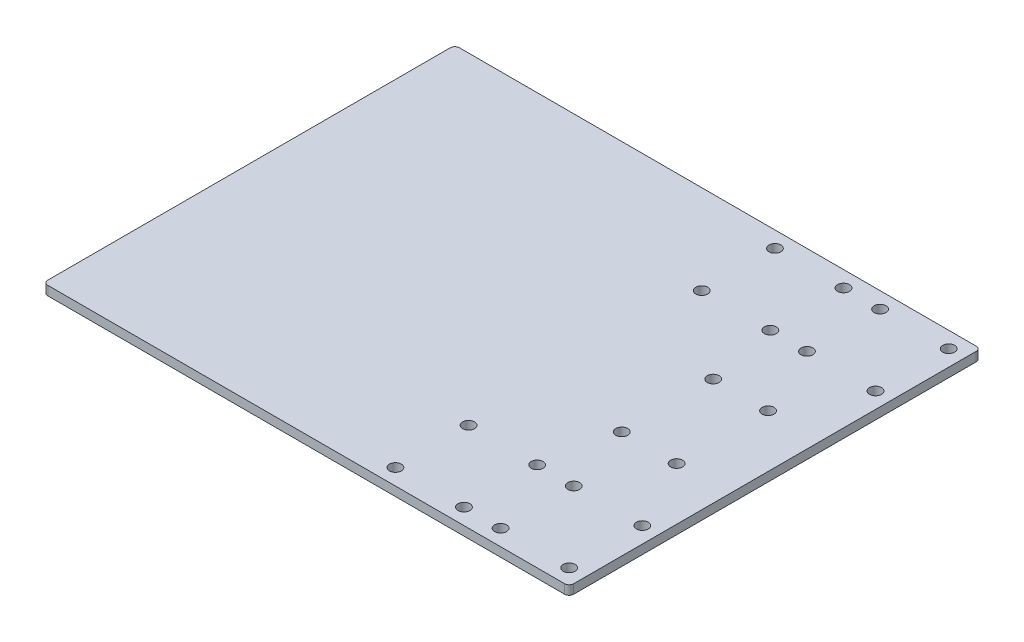
ISO-10303-21;
HEADER;
FILE_DESCRIPTION(('STEP AP214'),'2;1');
FILE_NAME('part.step','',(''),(''),'','','');
FILE_SCHEMA(('AUTOMOTIVE_DESIGN { 1 0 10303 214 1 1 1 1 }'));
ENDSEC;
DATA;
#1=APPLICATION_CONTEXT('core data for automotive mechanical design processes');
#2=APPLICATION_PROTOCOL_DEFINITION('international standard','automotive_design',2000,#1);
#3=PRODUCT_CONTEXT('',#1,'mechanical');
#4=PRODUCT('Part','Part','',(#3));
#5=PRODUCT_RELATED_PRODUCT_CATEGORY('part','',(#4));
#6=PRODUCT_DEFINITION_FORMATION('','',#4);
#7=PRODUCT_DEFINITION_CONTEXT('part definition',#1,'design');
#8=PRODUCT_DEFINITION('design','',#6,#7);
#9=PRODUCT_DEFINITION_SHAPE('','',#8);
#10=(LENGTH_UNIT() NAMED_UNIT(*) SI_UNIT(.MILLI.,.METRE.));
#11=(NAMED_UNIT(*) PLANE_ANGLE_UNIT() SI_UNIT($,.RADIAN.));
#12=(NAMED_UNIT(*) SI_UNIT($,.STERADIAN.) SOLID_ANGLE_UNIT());
#13=UNCERTAINTY_MEASURE_WITH_UNIT(LENGTH_MEASURE(1.E-05),#10,'distance_accuracy_value','');
#14=(GEOMETRIC_REPRESENTATION_CONTEXT(3) GLOBAL_UNCERTAINTY_ASSIGNED_CONTEXT((#13)) GLOBAL_UNIT_ASSIGNED_CONTEXT((#10,
#11,#12)) REPRESENTATION_CONTEXT('',''));
#15=CARTESIAN_POINT('',(0.,0.,0.));
#16=DIRECTION('',(0.,0.,1.));
#17=DIRECTION('',(1.,0.,0.));
#18=AXIS2_PLACEMENT_3D('',#15,#16,#17);
#19=CARTESIAN_POINT('',(0.,4.,0.));
#20=DIRECTION('',(1.,0.,0.));
#21=DIRECTION('',(0.,0.,-1.));
#22=AXIS2_PLACEMENT_3D('',#19,#20,#21);
#23=PLANE('',#22);
#24=DIRECTION('',(0.,0.,1.));
#25=VECTOR('',#24,1.);
#26=CARTESIAN_POINT('',(0.,4.,0.));
#27=LINE('',#26,#25);
#28=CARTESIAN_POINT('',(0.,4.,-178.));
#29=VERTEX_POINT('',#28);
#30=CARTESIAN_POINT('',(0.,4.,-2.));
#31=VERTEX_POINT('',#30);
#32=EDGE_CURVE('E130',#29,#31,#27,.T.);
#33=ORIENTED_EDGE('',*,*,#32,.F.);
#34=DIRECTION('',(0.,-1.,0.));
#35=VECTOR('',#34,1.);
#36=CARTESIAN_POINT('',(0.,4.,-178.));
#37=LINE('',#36,#35);
#38=CARTESIAN_POINT('',(0.,0.,-178.));
#39=VERTEX_POINT('',#38);
#40=EDGE_CURVE('E11',#29,#39,#37,.T.);
#41=ORIENTED_EDGE('',*,*,#40,.T.);
#42=DIRECTION('',(0.,0.,1.));
#43=VECTOR('',#42,1.);
#44=CARTESIAN_POINT('',(0.,0.,0.));
#45=LINE('',#44,#43);
#46=CARTESIAN_POINT('',(0.,0.,-2.));
#47=VERTEX_POINT('',#46);
#48=EDGE_CURVE('E132',#39,#47,#45,.T.);
#49=ORIENTED_EDGE('',*,*,#48,.T.);
#50=DIRECTION('',(0.,-1.,0.));
#51=VECTOR('',#50,1.);
#52=CARTESIAN_POINT('',(0.,4.,-2.));
#53=LINE('',#52,#51);
#54=EDGE_CURVE('E43',#47,#31,#53,.F.);
#55=ORIENTED_EDGE('',*,*,#54,.T.);
#56=EDGE_LOOP('',(#33,#41,#49,#55));
#57=FACE_BOUND('',#56,.T.);
#58=ADVANCED_FACE('F35',(#57),#23,.F.);
#59=CARTESIAN_POINT('',(0.,4.,0.));
#60=DIRECTION('',(0.,0.,-1.));
#61=DIRECTION('',(-1.,0.,0.));
#62=AXIS2_PLACEMENT_3D('',#59,#60,#61);
#63=PLANE('',#62);
#64=DIRECTION('',(1.,0.,0.));
#65=VECTOR('',#64,1.);
#66=CARTESIAN_POINT('',(0.,0.,0.));
#67=LINE('',#66,#65);
#68=CARTESIAN_POINT('',(2.,0.,0.));
#69=VERTEX_POINT('',#68);
#70=CARTESIAN_POINT('',(228.,0.,0.));
#71=VERTEX_POINT('',#70);
#72=EDGE_CURVE('E128',#69,#71,#67,.T.);
#73=ORIENTED_EDGE('',*,*,#72,.T.);
#74=DIRECTION('',(0.,-1.,0.));
#75=VECTOR('',#74,1.);
#76=CARTESIAN_POINT('',(228.,4.,0.));
#77=LINE('',#76,#75);
#78=CARTESIAN_POINT('',(228.,4.,0.));
#79=VERTEX_POINT('',#78);
#80=EDGE_CURVE('E107',#71,#79,#77,.F.);
#81=ORIENTED_EDGE('',*,*,#80,.T.);
#82=DIRECTION('',(1.,0.,0.));
#83=VECTOR('',#82,1.);
#84=CARTESIAN_POINT('',(0.,4.,0.));
#85=LINE('',#84,#83);
#86=CARTESIAN_POINT('',(2.,4.,0.));
#87=VERTEX_POINT('',#86);
#88=EDGE_CURVE('E168',#87,#79,#85,.T.);
#89=ORIENTED_EDGE('',*,*,#88,.F.);
#90=DIRECTION('',(0.,-1.,0.));
#91=VECTOR('',#90,1.);
#92=CARTESIAN_POINT('',(2.,4.,0.));
#93=LINE('',#92,#91);
#94=EDGE_CURVE('E112',#87,#69,#93,.T.);
#95=ORIENTED_EDGE('',*,*,#94,.T.);
#96=EDGE_LOOP('',(#73,#81,#89,#95));
#97=FACE_BOUND('',#96,.T.);
#98=ADVANCED_FACE('F172',(#97),#63,.F.);
#99=CARTESIAN_POINT('',(230.,4.,-180.));
#100=DIRECTION('',(-1.,0.,0.));
#101=DIRECTION('',(0.,0.,1.));
#102=AXIS2_PLACEMENT_3D('',#99,#100,#101);
#103=PLANE('',#102);
#104=DIRECTION('',(0.,0.,-1.));
#105=VECTOR('',#104,1.);
#106=CARTESIAN_POINT('',(230.,4.,-180.));
#107=LINE('',#106,#105);
#108=CARTESIAN_POINT('',(230.,4.,-2.00000000000006));
#109=VERTEX_POINT('',#108);
#110=CARTESIAN_POINT('',(230.,4.,-178.));
#111=VERTEX_POINT('',#110);
#112=EDGE_CURVE('E121',#109,#111,#107,.T.);
#113=ORIENTED_EDGE('',*,*,#112,.F.);
#114=DIRECTION('',(0.,-1.,0.));
#115=VECTOR('',#114,1.);
#116=CARTESIAN_POINT('',(230.,4.,-2.));
#117=LINE('',#116,#115);
#118=CARTESIAN_POINT('',(230.,0.,-2.00000000000006));
#119=VERTEX_POINT('',#118);
#120=EDGE_CURVE('E106',#109,#119,#117,.T.);
#121=ORIENTED_EDGE('',*,*,#120,.T.);
#122=DIRECTION('',(0.,0.,-1.));
#123=VECTOR('',#122,1.);
#124=CARTESIAN_POINT('',(230.,0.,-180.));
#125=LINE('',#124,#123);
#126=CARTESIAN_POINT('',(230.,0.,-178.));
#127=VERTEX_POINT('',#126);
#128=EDGE_CURVE('E119',#119,#127,#125,.T.);
#129=ORIENTED_EDGE('',*,*,#128,.T.);
#130=DIRECTION('',(0.,-1.,0.));
#131=VECTOR('',#130,1.);
#132=CARTESIAN_POINT('',(230.,4.,-178.));
#133=LINE('',#132,#131);
#134=EDGE_CURVE('E123',#127,#111,#133,.F.);
#135=ORIENTED_EDGE('',*,*,#134,.T.);
#136=EDGE_LOOP('',(#113,#121,#129,#135));
#137=FACE_BOUND('',#136,.T.);
#138=ADVANCED_FACE('F118',(#137),#103,.F.);
#139=CARTESIAN_POINT('',(0.,4.,-180.));
#140=DIRECTION('',(0.,0.,1.));
#141=DIRECTION('',(1.,0.,0.));
#142=AXIS2_PLACEMENT_3D('',#139,#140,#141);
#143=PLANE('',#142);
#144=DIRECTION('',(-1.,0.,0.));
#145=VECTOR('',#144,1.);
#146=CARTESIAN_POINT('',(0.,4.,-180.));
#147=LINE('',#146,#145);
#148=CARTESIAN_POINT('',(228.,4.,-180.));
#149=VERTEX_POINT('',#148);
#150=CARTESIAN_POINT('',(2.,4.,-180.));
#151=VERTEX_POINT('',#150);
#152=EDGE_CURVE('E136',#149,#151,#147,.T.);
#153=ORIENTED_EDGE('',*,*,#152,.F.);
#154=DIRECTION('',(0.,-1.,0.));
#155=VECTOR('',#154,1.);
#156=CARTESIAN_POINT('',(228.,4.,-180.));
#157=LINE('',#156,#155);
#158=CARTESIAN_POINT('',(228.,0.,-180.));
#159=VERTEX_POINT('',#158);
#160=EDGE_CURVE('E153',#149,#159,#157,.T.);
#161=ORIENTED_EDGE('',*,*,#160,.T.);
#162=DIRECTION('',(-1.,0.,0.));
#163=VECTOR('',#162,1.);
#164=CARTESIAN_POINT('',(0.,0.,-180.));
#165=LINE('',#164,#163);
#166=CARTESIAN_POINT('',(2.,0.,-180.));
#167=VERTEX_POINT('',#166);
#168=EDGE_CURVE('E127',#159,#167,#165,.T.);
#169=ORIENTED_EDGE('',*,*,#168,.T.);
#170=DIRECTION('',(0.,-1.,0.));
#171=VECTOR('',#170,1.);
#172=CARTESIAN_POINT('',(2.,4.,-180.));
#173=LINE('',#172,#171);
#174=EDGE_CURVE('E50',#167,#151,#173,.F.);
#175=ORIENTED_EDGE('',*,*,#174,.T.);
#176=EDGE_LOOP('',(#153,#161,#169,#175));
#177=FACE_BOUND('',#176,.T.);
#178=ADVANCED_FACE('F302',(#177),#143,.F.);
#179=CARTESIAN_POINT('',(0.,4.,0.));
#180=DIRECTION('',(0.,-1.,0.));
#181=DIRECTION('',(0.,0.,-1.));
#182=AXIS2_PLACEMENT_3D('',#179,#180,#181);
#183=PLANE('',#182);
#184=CARTESIAN_POINT('',(183.,4.,-70.));
#185=DIRECTION('',(0.,1.,0.));
#186=DIRECTION('',(0.,0.,1.));
#187=AXIS2_PLACEMENT_3D('',#184,#185,#186);
#188=CIRCLE('',#187,2.59999999999999);
#189=CARTESIAN_POINT('',(183.,4.,-67.4));
#190=VERTEX_POINT('',#189);
#191=EDGE_CURVE('E294',#190,#190,#188,.T.);
#192=ORIENTED_EDGE('',*,*,#191,.F.);
#193=EDGE_LOOP('',(#192));
#194=FACE_BOUND('',#193,.T.);
#195=CARTESIAN_POINT('',(183.,4.,-110.));
#196=DIRECTION('',(0.,1.,0.));
#197=DIRECTION('',(0.,0.,1.));
#198=AXIS2_PLACEMENT_3D('',#195,#196,#197);
#199=CIRCLE('',#198,2.59999999999999);
#200=CARTESIAN_POINT('',(183.,4.,-107.4));
#201=VERTEX_POINT('',#200);
#202=EDGE_CURVE('E288',#201,#201,#199,.T.);
#203=ORIENTED_EDGE('',*,*,#202,.F.);
#204=EDGE_LOOP('',(#203));
#205=FACE_BOUND('',#204,.T.);
#206=CARTESIAN_POINT('',(207.,4.,-70.));
#207=DIRECTION('',(0.,1.,0.));
#208=DIRECTION('',(0.,0.,1.));
#209=AXIS2_PLACEMENT_3D('',#206,#207,#208);
#210=CIRCLE('',#209,2.59999999999999);
#211=CARTESIAN_POINT('',(207.,4.,-67.4));
#212=VERTEX_POINT('',#211);
#213=EDGE_CURVE('E282',#212,#212,#210,.T.);
#214=ORIENTED_EDGE('',*,*,#213,.F.);
#215=EDGE_LOOP('',(#214));
#216=FACE_BOUND('',#215,.T.);
#217=CARTESIAN_POINT('',(207.,4.,-110.));
#218=DIRECTION('',(0.,1.,0.));
#219=DIRECTION('',(0.,0.,1.));
#220=AXIS2_PLACEMENT_3D('',#217,#218,#219);
#221=CIRCLE('',#220,2.59999999999999);
#222=CARTESIAN_POINT('',(207.,4.,-107.4));
#223=VERTEX_POINT('',#222);
#224=EDGE_CURVE('E276',#223,#223,#221,.T.);
#225=ORIENTED_EDGE('',*,*,#224,.F.);
#226=EDGE_LOOP('',(#225));
#227=FACE_BOUND('',#226,.T.);
#228=CARTESIAN_POINT('',(223.,4.,-39.));
#229=DIRECTION('',(0.,1.,0.));
#230=DIRECTION('',(0.,0.,1.));
#231=AXIS2_PLACEMENT_3D('',#228,#229,#230);
#232=CIRCLE('',#231,2.59999999999999);
#233=CARTESIAN_POINT('',(223.,4.,-36.4));
#234=VERTEX_POINT('',#233);
#235=EDGE_CURVE('E270',#234,#234,#232,.T.);
#236=ORIENTED_EDGE('',*,*,#235,.F.);
#237=EDGE_LOOP('',(#236));
#238=FACE_BOUND('',#237,.T.);
#239=CARTESIAN_POINT('',(223.,4.,-7.));
#240=DIRECTION('',(0.,1.,0.));
#241=DIRECTION('',(0.,0.,1.));
#242=AXIS2_PLACEMENT_3D('',#239,#240,#241);
#243=CIRCLE('',#242,2.59999999999999);
#244=CARTESIAN_POINT('',(223.,4.,-4.40000000000001));
#245=VERTEX_POINT('',#244);
#246=EDGE_CURVE('E264',#245,#245,#243,.T.);
#247=ORIENTED_EDGE('',*,*,#246,.F.);
#248=EDGE_LOOP('',(#247));
#249=FACE_BOUND('',#248,.T.);
#250=CARTESIAN_POINT('',(193.,4.,-7.));
#251=DIRECTION('',(0.,1.,0.));
#252=DIRECTION('',(0.,0.,1.));
#253=AXIS2_PLACEMENT_3D('',#250,#251,#252);
#254=CIRCLE('',#253,2.59999999999999);
#255=CARTESIAN_POINT('',(193.,4.,-4.40000000000001));
#256=VERTEX_POINT('',#255);
#257=EDGE_CURVE('E258',#256,#256,#254,.T.);
#258=ORIENTED_EDGE('',*,*,#257,.F.);
#259=EDGE_LOOP('',(#258));
#260=FACE_BOUND('',#259,.T.);
#261=CARTESIAN_POINT('',(193.,4.,-39.));
#262=DIRECTION('',(0.,1.,0.));
#263=DIRECTION('',(0.,0.,1.));
#264=AXIS2_PLACEMENT_3D('',#261,#262,#263);
#265=CIRCLE('',#264,2.59999999999999);
#266=CARTESIAN_POINT('',(193.,4.,-36.4));
#267=VERTEX_POINT('',#266);
#268=EDGE_CURVE('E252',#267,#267,#265,.T.);
#269=ORIENTED_EDGE('',*,*,#268,.F.);
#270=EDGE_LOOP('',(#269));
#271=FACE_BOUND('',#270,.T.);
#272=CARTESIAN_POINT('',(147.,4.,-39.));
#273=DIRECTION('',(0.,1.,0.));
#274=DIRECTION('',(0.,0.,1.));
#275=AXIS2_PLACEMENT_3D('',#272,#273,#274);
#276=CIRCLE('',#275,2.59999999999999);
#277=CARTESIAN_POINT('',(147.,4.,-36.4));
#278=VERTEX_POINT('',#277);
#279=EDGE_CURVE('E246',#278,#278,#276,.T.);
#280=ORIENTED_EDGE('',*,*,#279,.F.);
#281=EDGE_LOOP('',(#280));
#282=FACE_BOUND('',#281,.T.);
#283=CARTESIAN_POINT('',(177.,4.,-39.));
#284=DIRECTION('',(0.,1.,0.));
#285=DIRECTION('',(0.,0.,1.));
#286=AXIS2_PLACEMENT_3D('',#283,#284,#285);
#287=CIRCLE('',#286,2.59999999999999);
#288=CARTESIAN_POINT('',(177.,4.,-36.4));
#289=VERTEX_POINT('',#288);
#290=EDGE_CURVE('E240',#289,#289,#287,.T.);
#291=ORIENTED_EDGE('',*,*,#290,.F.);
#292=EDGE_LOOP('',(#291));
#293=FACE_BOUND('',#292,.T.);
#294=CARTESIAN_POINT('',(147.,4.,-7.));
#295=DIRECTION('',(0.,1.,0.));
#296=DIRECTION('',(0.,0.,1.));
#297=AXIS2_PLACEMENT_3D('',#294,#295,#296);
#298=CIRCLE('',#297,2.59999999999999);
#299=CARTESIAN_POINT('',(147.,4.,-4.40000000000001));
#300=VERTEX_POINT('',#299);
#301=EDGE_CURVE('E234',#300,#300,#298,.T.);
#302=ORIENTED_EDGE('',*,*,#301,.F.);
#303=EDGE_LOOP('',(#302));
#304=FACE_BOUND('',#303,.T.);
#305=CARTESIAN_POINT('',(177.,4.,-7.));
#306=DIRECTION('',(0.,1.,0.));
#307=DIRECTION('',(0.,0.,1.));
#308=AXIS2_PLACEMENT_3D('',#305,#306,#307);
#309=CIRCLE('',#308,2.59999999999999);
#310=CARTESIAN_POINT('',(177.,4.,-4.40000000000001));
#311=VERTEX_POINT('',#310);
#312=EDGE_CURVE('E228',#311,#311,#309,.T.);
#313=ORIENTED_EDGE('',*,*,#312,.F.);
#314=EDGE_LOOP('',(#313));
#315=FACE_BOUND('',#314,.T.);
#316=CARTESIAN_POINT('',(193.,4.,-173.));
#317=DIRECTION('',(0.,1.,0.));
#318=DIRECTION('',(0.,0.,1.));
#319=AXIS2_PLACEMENT_3D('',#316,#317,#318);
#320=CIRCLE('',#319,2.59999999999999);
#321=CARTESIAN_POINT('',(193.,4.,-170.4));
#322=VERTEX_POINT('',#321);
#323=EDGE_CURVE('E222',#322,#322,#320,.T.);
#324=ORIENTED_EDGE('',*,*,#323,.F.);
#325=EDGE_LOOP('',(#324));
#326=FACE_BOUND('',#325,.T.);
#327=CARTESIAN_POINT('',(223.,4.,-173.));
#328=DIRECTION('',(0.,1.,0.));
#329=DIRECTION('',(0.,0.,1.));
#330=AXIS2_PLACEMENT_3D('',#327,#328,#329);
#331=CIRCLE('',#330,2.59999999999999);
#332=CARTESIAN_POINT('',(223.,4.,-170.4));
#333=VERTEX_POINT('',#332);
#334=EDGE_CURVE('E216',#333,#333,#331,.T.);
#335=ORIENTED_EDGE('',*,*,#334,.F.);
#336=EDGE_LOOP('',(#335));
#337=FACE_BOUND('',#336,.T.);
#338=CARTESIAN_POINT('',(223.,4.,-141.));
#339=DIRECTION('',(0.,1.,0.));
#340=DIRECTION('',(0.,0.,1.));
#341=AXIS2_PLACEMENT_3D('',#338,#339,#340);
#342=CIRCLE('',#341,2.59999999999999);
#343=CARTESIAN_POINT('',(223.,4.,-138.4));
#344=VERTEX_POINT('',#343);
#345=EDGE_CURVE('E210',#344,#344,#342,.T.);
#346=ORIENTED_EDGE('',*,*,#345,.F.);
#347=EDGE_LOOP('',(#346));
#348=FACE_BOUND('',#347,.T.);
#349=CARTESIAN_POINT('',(193.,4.,-141.));
#350=DIRECTION('',(0.,1.,0.));
#351=DIRECTION('',(0.,0.,1.));
#352=AXIS2_PLACEMENT_3D('',#349,#350,#351);
#353=CIRCLE('',#352,2.59999999999999);
#354=CARTESIAN_POINT('',(193.,4.,-138.4));
#355=VERTEX_POINT('',#354);
#356=EDGE_CURVE('E204',#355,#355,#353,.T.);
#357=ORIENTED_EDGE('',*,*,#356,.F.);
#358=EDGE_LOOP('',(#357));
#359=FACE_BOUND('',#358,.T.);
#360=CARTESIAN_POINT('',(177.,4.,-173.));
#361=DIRECTION('',(0.,1.,0.));
#362=DIRECTION('',(0.,0.,1.));
#363=AXIS2_PLACEMENT_3D('',#360,#361,#362);
#364=CIRCLE('',#363,2.59999999999999);
#365=CARTESIAN_POINT('',(177.,4.,-170.4));
#366=VERTEX_POINT('',#365);
#367=EDGE_CURVE('E198',#366,#366,#364,.T.);
#368=ORIENTED_EDGE('',*,*,#367,.F.);
#369=EDGE_LOOP('',(#368));
#370=FACE_BOUND('',#369,.T.);
#371=CARTESIAN_POINT('',(147.,4.,-173.));
#372=DIRECTION('',(0.,1.,0.));
#373=DIRECTION('',(0.,0.,1.));
#374=AXIS2_PLACEMENT_3D('',#371,#372,#373);
#375=CIRCLE('',#374,2.59999999999999);
#376=CARTESIAN_POINT('',(147.,4.,-170.4));
#377=VERTEX_POINT('',#376);
#378=EDGE_CURVE('E192',#377,#377,#375,.T.);
#379=ORIENTED_EDGE('',*,*,#378,.F.);
#380=EDGE_LOOP('',(#379));
#381=FACE_BOUND('',#380,.T.);
#382=CARTESIAN_POINT('',(177.,4.,-141.));
#383=DIRECTION('',(0.,1.,0.));
#384=DIRECTION('',(0.,0.,1.));
#385=AXIS2_PLACEMENT_3D('',#382,#383,#384);
#386=CIRCLE('',#385,2.59999999999999);
#387=CARTESIAN_POINT('',(177.,4.,-138.4));
#388=VERTEX_POINT('',#387);
#389=EDGE_CURVE('E186',#388,#388,#386,.T.);
#390=ORIENTED_EDGE('',*,*,#389,.F.);
#391=EDGE_LOOP('',(#390));
#392=FACE_BOUND('',#391,.T.);
#393=CARTESIAN_POINT('',(147.,4.,-141.));
#394=DIRECTION('',(0.,1.,0.));
#395=DIRECTION('',(0.,0.,1.));
#396=AXIS2_PLACEMENT_3D('',#393,#394,#395);
#397=CIRCLE('',#396,2.59999999999999);
#398=CARTESIAN_POINT('',(147.,4.,-138.4));
#399=VERTEX_POINT('',#398);
#400=EDGE_CURVE('E175',#399,#399,#397,.T.);
#401=ORIENTED_EDGE('',*,*,#400,.F.);
#402=EDGE_LOOP('',(#401));
#403=FACE_BOUND('',#402,.T.);
#404=ORIENTED_EDGE('',*,*,#88,.T.);
#405=CARTESIAN_POINT('',(228.,4.,-2.));
#406=DIRECTION('',(0.,-1.,0.));
#407=DIRECTION('',(0.,0.,-1.));
#408=AXIS2_PLACEMENT_3D('',#405,#406,#407);
#409=CIRCLE('',#408,2.);
#410=EDGE_CURVE('E150',#79,#109,#409,.F.);
#411=ORIENTED_EDGE('',*,*,#410,.T.);
#412=ORIENTED_EDGE('',*,*,#112,.T.);
#413=CARTESIAN_POINT('',(228.,4.,-178.));
#414=DIRECTION('',(0.,-1.,0.));
#415=DIRECTION('',(0.,0.,-1.));
#416=AXIS2_PLACEMENT_3D('',#413,#414,#415);
#417=CIRCLE('',#416,2.);
#418=EDGE_CURVE('E57',#111,#149,#417,.F.);
#419=ORIENTED_EDGE('',*,*,#418,.T.);
#420=ORIENTED_EDGE('',*,*,#152,.T.);
#421=CARTESIAN_POINT('',(2.,4.,-178.));
#422=DIRECTION('',(0.,-1.,0.));
#423=DIRECTION('',(0.,0.,-1.));
#424=AXIS2_PLACEMENT_3D('',#421,#422,#423);
#425=CIRCLE('',#424,2.);
#426=EDGE_CURVE('E147',#151,#29,#425,.F.);
#427=ORIENTED_EDGE('',*,*,#426,.T.);
#428=ORIENTED_EDGE('',*,*,#32,.T.);
#429=CARTESIAN_POINT('',(2.,4.,-2.));
#430=DIRECTION('',(0.,-1.,0.));
#431=DIRECTION('',(0.,0.,-1.));
#432=AXIS2_PLACEMENT_3D('',#429,#430,#431);
#433=CIRCLE('',#432,2.);
#434=EDGE_CURVE('E145',#31,#87,#433,.F.);
#435=ORIENTED_EDGE('',*,*,#434,.T.);
#436=EDGE_LOOP('',(#404,#411,#412,#419,#420,#427,#428,#435));
#437=FACE_BOUND('',#436,.T.);
#438=ADVANCED_FACE('F165',(#194,#205,#216,#227,#238,#249,#260,#271,#282,#293,#304,#315,#326,
#337,#348,#359,#370,#381,#392,#403,#437),#183,.F.);
#439=CARTESIAN_POINT('',(0.,0.,0.));
#440=DIRECTION('',(0.,-1.,0.));
#441=DIRECTION('',(0.,0.,-1.));
#442=AXIS2_PLACEMENT_3D('',#439,#440,#441);
#443=PLANE('',#442);
#444=CARTESIAN_POINT('',(183.,0.,-70.));
#445=DIRECTION('',(0.,1.,0.));
#446=DIRECTION('',(0.,0.,1.));
#447=AXIS2_PLACEMENT_3D('',#444,#445,#446);
#448=CIRCLE('',#447,2.59999999999999);
#449=CARTESIAN_POINT('',(183.,0.,-67.4));
#450=VERTEX_POINT('',#449);
#451=EDGE_CURVE('E291',#450,#450,#448,.T.);
#452=ORIENTED_EDGE('',*,*,#451,.T.);
#453=EDGE_LOOP('',(#452));
#454=FACE_BOUND('',#453,.T.);
#455=CARTESIAN_POINT('',(183.,0.,-110.));
#456=DIRECTION('',(0.,1.,0.));
#457=DIRECTION('',(0.,0.,1.));
#458=AXIS2_PLACEMENT_3D('',#455,#456,#457);
#459=CIRCLE('',#458,2.59999999999999);
#460=CARTESIAN_POINT('',(183.,0.,-107.4));
#461=VERTEX_POINT('',#460);
#462=EDGE_CURVE('E285',#461,#461,#459,.T.);
#463=ORIENTED_EDGE('',*,*,#462,.T.);
#464=EDGE_LOOP('',(#463));
#465=FACE_BOUND('',#464,.T.);
#466=CARTESIAN_POINT('',(207.,0.,-70.));
#467=DIRECTION('',(0.,1.,0.));
#468=DIRECTION('',(0.,0.,1.));
#469=AXIS2_PLACEMENT_3D('',#466,#467,#468);
#470=CIRCLE('',#469,2.59999999999999);
#471=CARTESIAN_POINT('',(207.,0.,-67.4));
#472=VERTEX_POINT('',#471);
#473=EDGE_CURVE('E279',#472,#472,#470,.T.);
#474=ORIENTED_EDGE('',*,*,#473,.T.);
#475=EDGE_LOOP('',(#474));
#476=FACE_BOUND('',#475,.T.);
#477=CARTESIAN_POINT('',(207.,0.,-110.));
#478=DIRECTION('',(0.,1.,0.));
#479=DIRECTION('',(0.,0.,1.));
#480=AXIS2_PLACEMENT_3D('',#477,#478,#479);
#481=CIRCLE('',#480,2.59999999999999);
#482=CARTESIAN_POINT('',(207.,0.,-107.4));
#483=VERTEX_POINT('',#482);
#484=EDGE_CURVE('E273',#483,#483,#481,.T.);
#485=ORIENTED_EDGE('',*,*,#484,.T.);
#486=EDGE_LOOP('',(#485));
#487=FACE_BOUND('',#486,.T.);
#488=CARTESIAN_POINT('',(223.,0.,-39.));
#489=DIRECTION('',(0.,1.,0.));
#490=DIRECTION('',(0.,0.,1.));
#491=AXIS2_PLACEMENT_3D('',#488,#489,#490);
#492=CIRCLE('',#491,2.59999999999999);
#493=CARTESIAN_POINT('',(223.,0.,-36.4));
#494=VERTEX_POINT('',#493);
#495=EDGE_CURVE('E267',#494,#494,#492,.T.);
#496=ORIENTED_EDGE('',*,*,#495,.T.);
#497=EDGE_LOOP('',(#496));
#498=FACE_BOUND('',#497,.T.);
#499=CARTESIAN_POINT('',(223.,0.,-7.));
#500=DIRECTION('',(0.,1.,0.));
#501=DIRECTION('',(0.,0.,1.));
#502=AXIS2_PLACEMENT_3D('',#499,#500,#501);
#503=CIRCLE('',#502,2.59999999999999);
#504=CARTESIAN_POINT('',(223.,0.,-4.40000000000001));
#505=VERTEX_POINT('',#504);
#506=EDGE_CURVE('E261',#505,#505,#503,.T.);
#507=ORIENTED_EDGE('',*,*,#506,.T.);
#508=EDGE_LOOP('',(#507));
#509=FACE_BOUND('',#508,.T.);
#510=CARTESIAN_POINT('',(193.,0.,-7.));
#511=DIRECTION('',(0.,1.,0.));
#512=DIRECTION('',(0.,0.,1.));
#513=AXIS2_PLACEMENT_3D('',#510,#511,#512);
#514=CIRCLE('',#513,2.59999999999999);
#515=CARTESIAN_POINT('',(193.,0.,-4.40000000000001));
#516=VERTEX_POINT('',#515);
#517=EDGE_CURVE('E255',#516,#516,#514,.T.);
#518=ORIENTED_EDGE('',*,*,#517,.T.);
#519=EDGE_LOOP('',(#518));
#520=FACE_BOUND('',#519,.T.);
#521=CARTESIAN_POINT('',(193.,0.,-39.));
#522=DIRECTION('',(0.,1.,0.));
#523=DIRECTION('',(0.,0.,1.));
#524=AXIS2_PLACEMENT_3D('',#521,#522,#523);
#525=CIRCLE('',#524,2.59999999999999);
#526=CARTESIAN_POINT('',(193.,0.,-36.4));
#527=VERTEX_POINT('',#526);
#528=EDGE_CURVE('E249',#527,#527,#525,.T.);
#529=ORIENTED_EDGE('',*,*,#528,.T.);
#530=EDGE_LOOP('',(#529));
#531=FACE_BOUND('',#530,.T.);
#532=CARTESIAN_POINT('',(147.,0.,-39.));
#533=DIRECTION('',(0.,1.,0.));
#534=DIRECTION('',(0.,0.,1.));
#535=AXIS2_PLACEMENT_3D('',#532,#533,#534);
#536=CIRCLE('',#535,2.59999999999999);
#537=CARTESIAN_POINT('',(147.,0.,-36.4));
#538=VERTEX_POINT('',#537);
#539=EDGE_CURVE('E243',#538,#538,#536,.T.);
#540=ORIENTED_EDGE('',*,*,#539,.T.);
#541=EDGE_LOOP('',(#540));
#542=FACE_BOUND('',#541,.T.);
#543=CARTESIAN_POINT('',(177.,0.,-39.));
#544=DIRECTION('',(0.,1.,0.));
#545=DIRECTION('',(0.,0.,1.));
#546=AXIS2_PLACEMENT_3D('',#543,#544,#545);
#547=CIRCLE('',#546,2.59999999999999);
#548=CARTESIAN_POINT('',(177.,0.,-36.4));
#549=VERTEX_POINT('',#548);
#550=EDGE_CURVE('E237',#549,#549,#547,.T.);
#551=ORIENTED_EDGE('',*,*,#550,.T.);
#552=EDGE_LOOP('',(#551));
#553=FACE_BOUND('',#552,.T.);
#554=CARTESIAN_POINT('',(147.,0.,-7.));
#555=DIRECTION('',(0.,1.,0.));
#556=DIRECTION('',(0.,0.,1.));
#557=AXIS2_PLACEMENT_3D('',#554,#555,#556);
#558=CIRCLE('',#557,2.59999999999999);
#559=CARTESIAN_POINT('',(147.,0.,-4.40000000000001));
#560=VERTEX_POINT('',#559);
#561=EDGE_CURVE('E231',#560,#560,#558,.T.);
#562=ORIENTED_EDGE('',*,*,#561,.T.);
#563=EDGE_LOOP('',(#562));
#564=FACE_BOUND('',#563,.T.);
#565=CARTESIAN_POINT('',(177.,0.,-7.));
#566=DIRECTION('',(0.,1.,0.));
#567=DIRECTION('',(0.,0.,1.));
#568=AXIS2_PLACEMENT_3D('',#565,#566,#567);
#569=CIRCLE('',#568,2.59999999999999);
#570=CARTESIAN_POINT('',(177.,0.,-4.40000000000001));
#571=VERTEX_POINT('',#570);
#572=EDGE_CURVE('E225',#571,#571,#569,.T.);
#573=ORIENTED_EDGE('',*,*,#572,.T.);
#574=EDGE_LOOP('',(#573));
#575=FACE_BOUND('',#574,.T.);
#576=CARTESIAN_POINT('',(193.,0.,-173.));
#577=DIRECTION('',(0.,1.,0.));
#578=DIRECTION('',(0.,0.,1.));
#579=AXIS2_PLACEMENT_3D('',#576,#577,#578);
#580=CIRCLE('',#579,2.59999999999999);
#581=CARTESIAN_POINT('',(193.,0.,-170.4));
#582=VERTEX_POINT('',#581);
#583=EDGE_CURVE('E219',#582,#582,#580,.T.);
#584=ORIENTED_EDGE('',*,*,#583,.T.);
#585=EDGE_LOOP('',(#584));
#586=FACE_BOUND('',#585,.T.);
#587=CARTESIAN_POINT('',(223.,0.,-173.));
#588=DIRECTION('',(0.,1.,0.));
#589=DIRECTION('',(0.,0.,1.));
#590=AXIS2_PLACEMENT_3D('',#587,#588,#589);
#591=CIRCLE('',#590,2.59999999999999);
#592=CARTESIAN_POINT('',(223.,0.,-170.4));
#593=VERTEX_POINT('',#592);
#594=EDGE_CURVE('E213',#593,#593,#591,.T.);
#595=ORIENTED_EDGE('',*,*,#594,.T.);
#596=EDGE_LOOP('',(#595));
#597=FACE_BOUND('',#596,.T.);
#598=CARTESIAN_POINT('',(223.,0.,-141.));
#599=DIRECTION('',(0.,1.,0.));
#600=DIRECTION('',(0.,0.,1.));
#601=AXIS2_PLACEMENT_3D('',#598,#599,#600);
#602=CIRCLE('',#601,2.59999999999999);
#603=CARTESIAN_POINT('',(223.,0.,-138.4));
#604=VERTEX_POINT('',#603);
#605=EDGE_CURVE('E207',#604,#604,#602,.T.);
#606=ORIENTED_EDGE('',*,*,#605,.T.);
#607=EDGE_LOOP('',(#606));
#608=FACE_BOUND('',#607,.T.);
#609=CARTESIAN_POINT('',(193.,0.,-141.));
#610=DIRECTION('',(0.,1.,0.));
#611=DIRECTION('',(0.,0.,1.));
#612=AXIS2_PLACEMENT_3D('',#609,#610,#611);
#613=CIRCLE('',#612,2.59999999999999);
#614=CARTESIAN_POINT('',(193.,0.,-138.4));
#615=VERTEX_POINT('',#614);
#616=EDGE_CURVE('E201',#615,#615,#613,.T.);
#617=ORIENTED_EDGE('',*,*,#616,.T.);
#618=EDGE_LOOP('',(#617));
#619=FACE_BOUND('',#618,.T.);
#620=CARTESIAN_POINT('',(177.,0.,-173.));
#621=DIRECTION('',(0.,1.,0.));
#622=DIRECTION('',(0.,0.,1.));
#623=AXIS2_PLACEMENT_3D('',#620,#621,#622);
#624=CIRCLE('',#623,2.59999999999999);
#625=CARTESIAN_POINT('',(177.,0.,-170.4));
#626=VERTEX_POINT('',#625);
#627=EDGE_CURVE('E195',#626,#626,#624,.T.);
#628=ORIENTED_EDGE('',*,*,#627,.T.);
#629=EDGE_LOOP('',(#628));
#630=FACE_BOUND('',#629,.T.);
#631=CARTESIAN_POINT('',(147.,0.,-173.));
#632=DIRECTION('',(0.,1.,0.));
#633=DIRECTION('',(0.,0.,1.));
#634=AXIS2_PLACEMENT_3D('',#631,#632,#633);
#635=CIRCLE('',#634,2.59999999999999);
#636=CARTESIAN_POINT('',(147.,0.,-170.4));
#637=VERTEX_POINT('',#636);
#638=EDGE_CURVE('E189',#637,#637,#635,.T.);
#639=ORIENTED_EDGE('',*,*,#638,.T.);
#640=EDGE_LOOP('',(#639));
#641=FACE_BOUND('',#640,.T.);
#642=CARTESIAN_POINT('',(177.,0.,-141.));
#643=DIRECTION('',(0.,1.,0.));
#644=DIRECTION('',(0.,0.,1.));
#645=AXIS2_PLACEMENT_3D('',#642,#643,#644);
#646=CIRCLE('',#645,2.59999999999999);
#647=CARTESIAN_POINT('',(177.,0.,-138.4));
#648=VERTEX_POINT('',#647);
#649=EDGE_CURVE('E183',#648,#648,#646,.T.);
#650=ORIENTED_EDGE('',*,*,#649,.T.);
#651=EDGE_LOOP('',(#650));
#652=FACE_BOUND('',#651,.T.);
#653=CARTESIAN_POINT('',(147.,0.,-141.));
#654=DIRECTION('',(0.,1.,0.));
#655=DIRECTION('',(0.,0.,1.));
#656=AXIS2_PLACEMENT_3D('',#653,#654,#655);
#657=CIRCLE('',#656,2.59999999999999);
#658=CARTESIAN_POINT('',(147.,0.,-138.4));
#659=VERTEX_POINT('',#658);
#660=EDGE_CURVE('E173',#659,#659,#657,.T.);
#661=ORIENTED_EDGE('',*,*,#660,.T.);
#662=EDGE_LOOP('',(#661));
#663=FACE_BOUND('',#662,.T.);
#664=ORIENTED_EDGE('',*,*,#128,.F.);
#665=CARTESIAN_POINT('',(228.,0.,-2.));
#666=DIRECTION('',(0.,-1.,0.));
#667=DIRECTION('',(0.,0.,-1.));
#668=AXIS2_PLACEMENT_3D('',#665,#666,#667);
#669=CIRCLE('',#668,2.);
#670=EDGE_CURVE('E102',#119,#71,#669,.T.);
#671=ORIENTED_EDGE('',*,*,#670,.T.);
#672=ORIENTED_EDGE('',*,*,#72,.F.);
#673=CARTESIAN_POINT('',(2.,0.,-2.));
#674=DIRECTION('',(0.,-1.,0.));
#675=DIRECTION('',(0.,0.,-1.));
#676=AXIS2_PLACEMENT_3D('',#673,#674,#675);
#677=CIRCLE('',#676,2.);
#678=EDGE_CURVE('E122',#69,#47,#677,.T.);
#679=ORIENTED_EDGE('',*,*,#678,.T.);
#680=ORIENTED_EDGE('',*,*,#48,.F.);
#681=CARTESIAN_POINT('',(2.,0.,-178.));
#682=DIRECTION('',(0.,-1.,0.));
#683=DIRECTION('',(0.,0.,-1.));
#684=AXIS2_PLACEMENT_3D('',#681,#682,#683);
#685=CIRCLE('',#684,2.);
#686=EDGE_CURVE('E139',#39,#167,#685,.T.);
#687=ORIENTED_EDGE('',*,*,#686,.T.);
#688=ORIENTED_EDGE('',*,*,#168,.F.);
#689=CARTESIAN_POINT('',(228.,0.,-178.));
#690=DIRECTION('',(0.,-1.,0.));
#691=DIRECTION('',(0.,0.,-1.));
#692=AXIS2_PLACEMENT_3D('',#689,#690,#691);
#693=CIRCLE('',#692,2.);
#694=EDGE_CURVE('E113',#159,#127,#693,.T.);
#695=ORIENTED_EDGE('',*,*,#694,.T.);
#696=EDGE_LOOP('',(#664,#671,#672,#679,#680,#687,#688,#695));
#697=FACE_BOUND('',#696,.T.);
#698=ADVANCED_FACE('F125',(#454,#465,#476,#487,#498,#509,#520,#531,#542,#553,#564,#575,#586,
#597,#608,#619,#630,#641,#652,#663,#697),#443,.T.);
#699=CARTESIAN_POINT('',(147.,4.,-141.));
#700=DIRECTION('',(0.,1.,0.));
#701=DIRECTION('',(0.,0.,1.));
#702=AXIS2_PLACEMENT_3D('',#699,#700,#701);
#703=CYLINDRICAL_SURFACE('',#702,2.59999999999999);
#704=ORIENTED_EDGE('',*,*,#660,.F.);
#705=EDGE_LOOP('',(#704));
#706=FACE_BOUND('',#705,.T.);
#707=ORIENTED_EDGE('',*,*,#400,.T.);
#708=EDGE_LOOP('',(#707));
#709=FACE_BOUND('',#708,.T.);
#710=ADVANCED_FACE('F342',(#706,#709),#703,.F.);
#711=CARTESIAN_POINT('',(177.,4.,-141.));
#712=DIRECTION('',(0.,1.,0.));
#713=DIRECTION('',(0.,0.,1.));
#714=AXIS2_PLACEMENT_3D('',#711,#712,#713);
#715=CYLINDRICAL_SURFACE('',#714,2.59999999999999);
#716=ORIENTED_EDGE('',*,*,#649,.F.);
#717=EDGE_LOOP('',(#716));
#718=FACE_BOUND('',#717,.T.);
#719=ORIENTED_EDGE('',*,*,#389,.T.);
#720=EDGE_LOOP('',(#719));
#721=FACE_BOUND('',#720,.T.);
#722=ADVANCED_FACE('F344',(#718,#721),#715,.F.);
#723=CARTESIAN_POINT('',(147.,4.,-173.));
#724=DIRECTION('',(0.,1.,0.));
#725=DIRECTION('',(0.,0.,1.));
#726=AXIS2_PLACEMENT_3D('',#723,#724,#725);
#727=CYLINDRICAL_SURFACE('',#726,2.59999999999999);
#728=ORIENTED_EDGE('',*,*,#638,.F.);
#729=EDGE_LOOP('',(#728));
#730=FACE_BOUND('',#729,.T.);
#731=ORIENTED_EDGE('',*,*,#378,.T.);
#732=EDGE_LOOP('',(#731));
#733=FACE_BOUND('',#732,.T.);
#734=ADVANCED_FACE('F351',(#730,#733),#727,.F.);
#735=CARTESIAN_POINT('',(177.,4.,-173.));
#736=DIRECTION('',(0.,1.,0.));
#737=DIRECTION('',(0.,0.,1.));
#738=AXIS2_PLACEMENT_3D('',#735,#736,#737);
#739=CYLINDRICAL_SURFACE('',#738,2.59999999999999);
#740=ORIENTED_EDGE('',*,*,#627,.F.);
#741=EDGE_LOOP('',(#740));
#742=FACE_BOUND('',#741,.T.);
#743=ORIENTED_EDGE('',*,*,#367,.T.);
#744=EDGE_LOOP('',(#743));
#745=FACE_BOUND('',#744,.T.);
#746=ADVANCED_FACE('F591',(#742,#745),#739,.F.);
#747=CARTESIAN_POINT('',(193.,4.,-141.));
#748=DIRECTION('',(0.,1.,0.));
#749=DIRECTION('',(0.,0.,1.));
#750=AXIS2_PLACEMENT_3D('',#747,#748,#749);
#751=CYLINDRICAL_SURFACE('',#750,2.59999999999999);
#752=ORIENTED_EDGE('',*,*,#616,.F.);
#753=EDGE_LOOP('',(#752));
#754=FACE_BOUND('',#753,.T.);
#755=ORIENTED_EDGE('',*,*,#356,.T.);
#756=EDGE_LOOP('',(#755));
#757=FACE_BOUND('',#756,.T.);
#758=ADVANCED_FACE('F581',(#754,#757),#751,.F.);
#759=CARTESIAN_POINT('',(223.,4.,-141.));
#760=DIRECTION('',(0.,1.,0.));
#761=DIRECTION('',(0.,0.,1.));
#762=AXIS2_PLACEMENT_3D('',#759,#760,#761);
#763=CYLINDRICAL_SURFACE('',#762,2.59999999999999);
#764=ORIENTED_EDGE('',*,*,#605,.F.);
#765=EDGE_LOOP('',(#764));
#766=FACE_BOUND('',#765,.T.);
#767=ORIENTED_EDGE('',*,*,#345,.T.);
#768=EDGE_LOOP('',(#767));
#769=FACE_BOUND('',#768,.T.);
#770=ADVANCED_FACE('F571',(#766,#769),#763,.F.);
#771=CARTESIAN_POINT('',(223.,4.,-173.));
#772=DIRECTION('',(0.,1.,0.));
#773=DIRECTION('',(0.,0.,1.));
#774=AXIS2_PLACEMENT_3D('',#771,#772,#773);
#775=CYLINDRICAL_SURFACE('',#774,2.59999999999999);
#776=ORIENTED_EDGE('',*,*,#594,.F.);
#777=EDGE_LOOP('',(#776));
#778=FACE_BOUND('',#777,.T.);
#779=ORIENTED_EDGE('',*,*,#334,.T.);
#780=EDGE_LOOP('',(#779));
#781=FACE_BOUND('',#780,.T.);
#782=ADVANCED_FACE('F561',(#778,#781),#775,.F.);
#783=CARTESIAN_POINT('',(193.,4.,-173.));
#784=DIRECTION('',(0.,1.,0.));
#785=DIRECTION('',(0.,0.,1.));
#786=AXIS2_PLACEMENT_3D('',#783,#784,#785);
#787=CYLINDRICAL_SURFACE('',#786,2.59999999999999);
#788=ORIENTED_EDGE('',*,*,#583,.F.);
#789=EDGE_LOOP('',(#788));
#790=FACE_BOUND('',#789,.T.);
#791=ORIENTED_EDGE('',*,*,#323,.T.);
#792=EDGE_LOOP('',(#791));
#793=FACE_BOUND('',#792,.T.);
#794=ADVANCED_FACE('F551',(#790,#793),#787,.F.);
#795=CARTESIAN_POINT('',(177.,4.,-7.));
#796=DIRECTION('',(0.,1.,0.));
#797=DIRECTION('',(0.,0.,1.));
#798=AXIS2_PLACEMENT_3D('',#795,#796,#797);
#799=CYLINDRICAL_SURFACE('',#798,2.59999999999999);
#800=ORIENTED_EDGE('',*,*,#572,.F.);
#801=EDGE_LOOP('',(#800));
#802=FACE_BOUND('',#801,.T.);
#803=ORIENTED_EDGE('',*,*,#312,.T.);
#804=EDGE_LOOP('',(#803));
#805=FACE_BOUND('',#804,.T.);
#806=ADVANCED_FACE('F541',(#802,#805),#799,.F.);
#807=CARTESIAN_POINT('',(147.,4.,-7.));
#808=DIRECTION('',(0.,1.,0.));
#809=DIRECTION('',(0.,0.,1.));
#810=AXIS2_PLACEMENT_3D('',#807,#808,#809);
#811=CYLINDRICAL_SURFACE('',#810,2.59999999999999);
#812=ORIENTED_EDGE('',*,*,#561,.F.);
#813=EDGE_LOOP('',(#812));
#814=FACE_BOUND('',#813,.T.);
#815=ORIENTED_EDGE('',*,*,#301,.T.);
#816=EDGE_LOOP('',(#815));
#817=FACE_BOUND('',#816,.T.);
#818=ADVANCED_FACE('F531',(#814,#817),#811,.F.);
#819=CARTESIAN_POINT('',(177.,4.,-39.));
#820=DIRECTION('',(0.,1.,0.));
#821=DIRECTION('',(0.,0.,1.));
#822=AXIS2_PLACEMENT_3D('',#819,#820,#821);
#823=CYLINDRICAL_SURFACE('',#822,2.59999999999999);
#824=ORIENTED_EDGE('',*,*,#550,.F.);
#825=EDGE_LOOP('',(#824));
#826=FACE_BOUND('',#825,.T.);
#827=ORIENTED_EDGE('',*,*,#290,.T.);
#828=EDGE_LOOP('',(#827));
#829=FACE_BOUND('',#828,.T.);
#830=ADVANCED_FACE('F521',(#826,#829),#823,.F.);
#831=CARTESIAN_POINT('',(147.,4.,-39.));
#832=DIRECTION('',(0.,1.,0.));
#833=DIRECTION('',(0.,0.,1.));
#834=AXIS2_PLACEMENT_3D('',#831,#832,#833);
#835=CYLINDRICAL_SURFACE('',#834,2.59999999999999);
#836=ORIENTED_EDGE('',*,*,#539,.F.);
#837=EDGE_LOOP('',(#836));
#838=FACE_BOUND('',#837,.T.);
#839=ORIENTED_EDGE('',*,*,#279,.T.);
#840=EDGE_LOOP('',(#839));
#841=FACE_BOUND('',#840,.T.);
#842=ADVANCED_FACE('F511',(#838,#841),#835,.F.);
#843=CARTESIAN_POINT('',(193.,4.,-39.));
#844=DIRECTION('',(0.,1.,0.));
#845=DIRECTION('',(0.,0.,1.));
#846=AXIS2_PLACEMENT_3D('',#843,#844,#845);
#847=CYLINDRICAL_SURFACE('',#846,2.59999999999999);
#848=ORIENTED_EDGE('',*,*,#528,.F.);
#849=EDGE_LOOP('',(#848));
#850=FACE_BOUND('',#849,.T.);
#851=ORIENTED_EDGE('',*,*,#268,.T.);
#852=EDGE_LOOP('',(#851));
#853=FACE_BOUND('',#852,.T.);
#854=ADVANCED_FACE('F501',(#850,#853),#847,.F.);
#855=CARTESIAN_POINT('',(193.,4.,-7.));
#856=DIRECTION('',(0.,1.,0.));
#857=DIRECTION('',(0.,0.,1.));
#858=AXIS2_PLACEMENT_3D('',#855,#856,#857);
#859=CYLINDRICAL_SURFACE('',#858,2.59999999999999);
#860=ORIENTED_EDGE('',*,*,#517,.F.);
#861=EDGE_LOOP('',(#860));
#862=FACE_BOUND('',#861,.T.);
#863=ORIENTED_EDGE('',*,*,#257,.T.);
#864=EDGE_LOOP('',(#863));
#865=FACE_BOUND('',#864,.T.);
#866=ADVANCED_FACE('F491',(#862,#865),#859,.F.);
#867=CARTESIAN_POINT('',(223.,4.,-7.));
#868=DIRECTION('',(0.,1.,0.));
#869=DIRECTION('',(0.,0.,1.));
#870=AXIS2_PLACEMENT_3D('',#867,#868,#869);
#871=CYLINDRICAL_SURFACE('',#870,2.59999999999999);
#872=ORIENTED_EDGE('',*,*,#506,.F.);
#873=EDGE_LOOP('',(#872));
#874=FACE_BOUND('',#873,.T.);
#875=ORIENTED_EDGE('',*,*,#246,.T.);
#876=EDGE_LOOP('',(#875));
#877=FACE_BOUND('',#876,.T.);
#878=ADVANCED_FACE('F481',(#874,#877),#871,.F.);
#879=CARTESIAN_POINT('',(223.,4.,-39.));
#880=DIRECTION('',(0.,1.,0.));
#881=DIRECTION('',(0.,0.,1.));
#882=AXIS2_PLACEMENT_3D('',#879,#880,#881);
#883=CYLINDRICAL_SURFACE('',#882,2.59999999999999);
#884=ORIENTED_EDGE('',*,*,#495,.F.);
#885=EDGE_LOOP('',(#884));
#886=FACE_BOUND('',#885,.T.);
#887=ORIENTED_EDGE('',*,*,#235,.T.);
#888=EDGE_LOOP('',(#887));
#889=FACE_BOUND('',#888,.T.);
#890=ADVANCED_FACE('F471',(#886,#889),#883,.F.);
#891=CARTESIAN_POINT('',(207.,4.,-110.));
#892=DIRECTION('',(0.,1.,0.));
#893=DIRECTION('',(0.,0.,1.));
#894=AXIS2_PLACEMENT_3D('',#891,#892,#893);
#895=CYLINDRICAL_SURFACE('',#894,2.59999999999999);
#896=ORIENTED_EDGE('',*,*,#484,.F.);
#897=EDGE_LOOP('',(#896));
#898=FACE_BOUND('',#897,.T.);
#899=ORIENTED_EDGE('',*,*,#224,.T.);
#900=EDGE_LOOP('',(#899));
#901=FACE_BOUND('',#900,.T.);
#902=ADVANCED_FACE('F461',(#898,#901),#895,.F.);
#903=CARTESIAN_POINT('',(207.,4.,-70.));
#904=DIRECTION('',(0.,1.,0.));
#905=DIRECTION('',(0.,0.,1.));
#906=AXIS2_PLACEMENT_3D('',#903,#904,#905);
#907=CYLINDRICAL_SURFACE('',#906,2.59999999999999);
#908=ORIENTED_EDGE('',*,*,#473,.F.);
#909=EDGE_LOOP('',(#908));
#910=FACE_BOUND('',#909,.T.);
#911=ORIENTED_EDGE('',*,*,#213,.T.);
#912=EDGE_LOOP('',(#911));
#913=FACE_BOUND('',#912,.T.);
#914=ADVANCED_FACE('F451',(#910,#913),#907,.F.);
#915=CARTESIAN_POINT('',(183.,4.,-110.));
#916=DIRECTION('',(0.,1.,0.));
#917=DIRECTION('',(0.,0.,1.));
#918=AXIS2_PLACEMENT_3D('',#915,#916,#917);
#919=CYLINDRICAL_SURFACE('',#918,2.59999999999999);
#920=ORIENTED_EDGE('',*,*,#462,.F.);
#921=EDGE_LOOP('',(#920));
#922=FACE_BOUND('',#921,.T.);
#923=ORIENTED_EDGE('',*,*,#202,.T.);
#924=EDGE_LOOP('',(#923));
#925=FACE_BOUND('',#924,.T.);
#926=ADVANCED_FACE('F441',(#922,#925),#919,.F.);
#927=CARTESIAN_POINT('',(183.,4.,-70.));
#928=DIRECTION('',(0.,1.,0.));
#929=DIRECTION('',(0.,0.,1.));
#930=AXIS2_PLACEMENT_3D('',#927,#928,#929);
#931=CYLINDRICAL_SURFACE('',#930,2.59999999999999);
#932=ORIENTED_EDGE('',*,*,#451,.F.);
#933=EDGE_LOOP('',(#932));
#934=FACE_BOUND('',#933,.T.);
#935=ORIENTED_EDGE('',*,*,#191,.T.);
#936=EDGE_LOOP('',(#935));
#937=FACE_BOUND('',#936,.T.);
#938=ADVANCED_FACE('F298',(#934,#937),#931,.F.);
#939=CARTESIAN_POINT('',(228.,4.,-2.));
#940=DIRECTION('',(0.,-1.,0.));
#941=DIRECTION('',(0.,0.,-1.));
#942=AXIS2_PLACEMENT_3D('',#939,#940,#941);
#943=CYLINDRICAL_SURFACE('',#942,2.);
#944=ORIENTED_EDGE('',*,*,#410,.F.);
#945=ORIENTED_EDGE('',*,*,#80,.F.);
#946=ORIENTED_EDGE('',*,*,#670,.F.);
#947=ORIENTED_EDGE('',*,*,#120,.F.);
#948=EDGE_LOOP('',(#944,#945,#946,#947));
#949=FACE_BOUND('',#948,.T.);
#950=ADVANCED_FACE('F105',(#949),#943,.T.);
#951=CARTESIAN_POINT('',(228.,4.,-178.));
#952=DIRECTION('',(0.,-1.,0.));
#953=DIRECTION('',(0.,0.,-1.));
#954=AXIS2_PLACEMENT_3D('',#951,#952,#953);
#955=CYLINDRICAL_SURFACE('',#954,2.);
#956=ORIENTED_EDGE('',*,*,#418,.F.);
#957=ORIENTED_EDGE('',*,*,#134,.F.);
#958=ORIENTED_EDGE('',*,*,#694,.F.);
#959=ORIENTED_EDGE('',*,*,#160,.F.);
#960=EDGE_LOOP('',(#956,#957,#958,#959));
#961=FACE_BOUND('',#960,.T.);
#962=ADVANCED_FACE('F367',(#961),#955,.T.);
#963=CARTESIAN_POINT('',(2.,4.,-178.));
#964=DIRECTION('',(0.,-1.,0.));
#965=DIRECTION('',(0.,0.,-1.));
#966=AXIS2_PLACEMENT_3D('',#963,#964,#965);
#967=CYLINDRICAL_SURFACE('',#966,2.);
#968=ORIENTED_EDGE('',*,*,#426,.F.);
#969=ORIENTED_EDGE('',*,*,#174,.F.);
#970=ORIENTED_EDGE('',*,*,#686,.F.);
#971=ORIENTED_EDGE('',*,*,#40,.F.);
#972=EDGE_LOOP('',(#968,#969,#970,#971));
#973=FACE_BOUND('',#972,.T.);
#974=ADVANCED_FACE('F369',(#973),#967,.T.);
#975=CARTESIAN_POINT('',(2.,4.,-2.));
#976=DIRECTION('',(0.,-1.,0.));
#977=DIRECTION('',(0.,0.,-1.));
#978=AXIS2_PLACEMENT_3D('',#975,#976,#977);
#979=CYLINDRICAL_SURFACE('',#978,2.);
#980=ORIENTED_EDGE('',*,*,#434,.F.);
#981=ORIENTED_EDGE('',*,*,#54,.F.);
#982=ORIENTED_EDGE('',*,*,#678,.F.);
#983=ORIENTED_EDGE('',*,*,#94,.F.);
#984=EDGE_LOOP('',(#980,#981,#982,#983));
#985=FACE_BOUND('',#984,.T.);
#986=ADVANCED_FACE('F37',(#985),#979,.T.);
#987=CLOSED_SHELL('',(#58,#98,#138,#178,#438,#698,#710,#722,#734,#746,#758,#770,#782,#794,#806,
#818,#830,#842,#854,#866,#878,#890,#902,#914,#926,#938,#950,#962,#974,#986));
#988=MANIFOLD_SOLID_BREP('B2',#987);
#989=ADVANCED_BREP_SHAPE_REPRESENTATION('',(#18,#988),#14);
#990=SHAPE_DEFINITION_REPRESENTATION(#9,#989);
ENDSEC;
END-ISO-10303-21;
